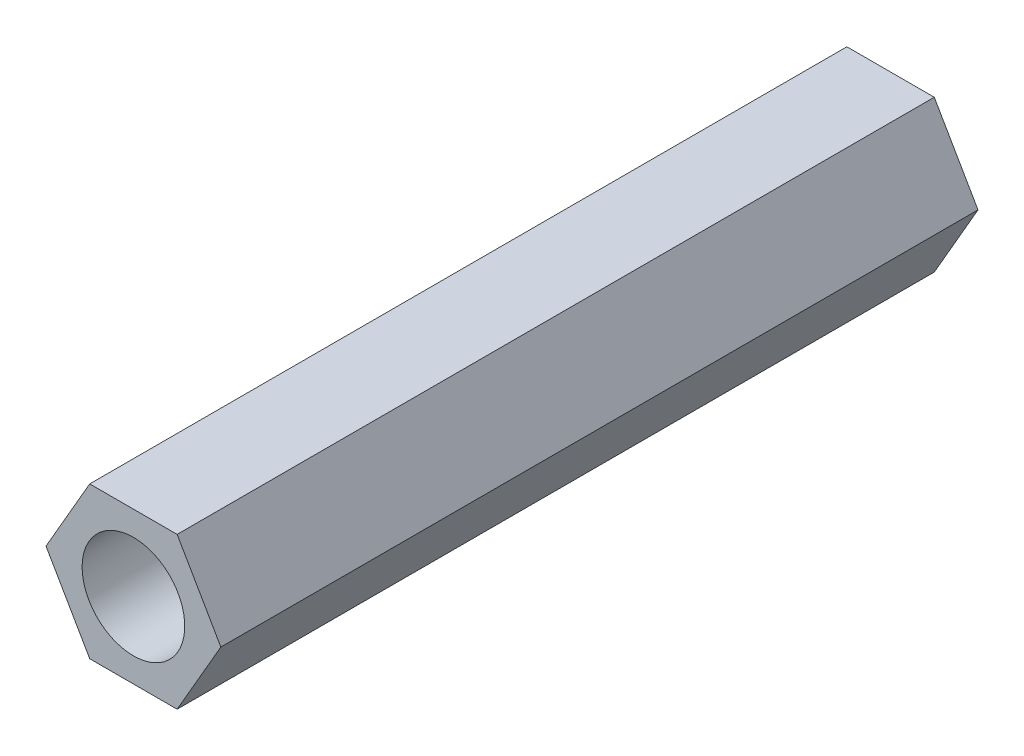
ISO-10303-21;
HEADER;
FILE_DESCRIPTION(('STEP AP214'),'2;1');
FILE_NAME('part.step','',(''),(''),'','','');
FILE_SCHEMA(('AUTOMOTIVE_DESIGN { 1 0 10303 214 1 1 1 1 }'));
ENDSEC;
DATA;
#1=APPLICATION_CONTEXT('core data for automotive mechanical design processes');
#2=APPLICATION_PROTOCOL_DEFINITION('international standard','automotive_design',2000,#1);
#3=PRODUCT_CONTEXT('',#1,'mechanical');
#4=PRODUCT('Part','Part','',(#3));
#5=PRODUCT_RELATED_PRODUCT_CATEGORY('part','',(#4));
#6=PRODUCT_DEFINITION_FORMATION('','',#4);
#7=PRODUCT_DEFINITION_CONTEXT('part definition',#1,'design');
#8=PRODUCT_DEFINITION('design','',#6,#7);
#9=PRODUCT_DEFINITION_SHAPE('','',#8);
#10=(LENGTH_UNIT() NAMED_UNIT(*) SI_UNIT(.MILLI.,.METRE.));
#11=(NAMED_UNIT(*) PLANE_ANGLE_UNIT() SI_UNIT($,.RADIAN.));
#12=(NAMED_UNIT(*) SI_UNIT($,.STERADIAN.) SOLID_ANGLE_UNIT());
#13=UNCERTAINTY_MEASURE_WITH_UNIT(LENGTH_MEASURE(1.E-05),#10,'distance_accuracy_value','');
#14=(GEOMETRIC_REPRESENTATION_CONTEXT(3) GLOBAL_UNCERTAINTY_ASSIGNED_CONTEXT((#13)) GLOBAL_UNIT_ASSIGNED_CONTEXT((#10,
#11,#12)) REPRESENTATION_CONTEXT('',''));
#15=CARTESIAN_POINT('',(0.,0.,0.));
#16=DIRECTION('',(0.,0.,1.));
#17=DIRECTION('',(1.,0.,0.));
#18=AXIS2_PLACEMENT_3D('',#15,#16,#17);
#19=CARTESIAN_POINT('',(1.83308710467706,-3.175,15.875));
#20=DIRECTION('',(-0.866025403784439,0.5,0.));
#21=DIRECTION('',(-0.5,-0.866025403784439,0.));
#22=AXIS2_PLACEMENT_3D('',#19,#20,#21);
#23=PLANE('',#22);
#24=DIRECTION('',(0.,0.,1.));
#25=VECTOR('',#24,1.);
#26=CARTESIAN_POINT('',(3.66617420935412,0.,15.875));
#27=LINE('',#26,#25);
#28=CARTESIAN_POINT('',(3.66617420935412,0.,-15.875));
#29=VERTEX_POINT('',#28);
#30=CARTESIAN_POINT('',(3.66617420935412,0.,15.875));
#31=VERTEX_POINT('',#30);
#32=EDGE_CURVE('E65',#29,#31,#27,.T.);
#33=ORIENTED_EDGE('',*,*,#32,.T.);
#34=DIRECTION('',(0.5,0.866025403784439,0.));
#35=VECTOR('',#34,1.);
#36=CARTESIAN_POINT('',(1.83308710467706,-3.175,15.875));
#37=LINE('',#36,#35);
#38=CARTESIAN_POINT('',(1.83308710467706,-3.175,15.875));
#39=VERTEX_POINT('',#38);
#40=EDGE_CURVE('E105',#39,#31,#37,.T.);
#41=ORIENTED_EDGE('',*,*,#40,.F.);
#42=DIRECTION('',(0.,0.,1.));
#43=VECTOR('',#42,1.);
#44=CARTESIAN_POINT('',(1.83308710467706,-3.175,15.875));
#45=LINE('',#44,#43);
#46=CARTESIAN_POINT('',(1.83308710467706,-3.175,-15.875));
#47=VERTEX_POINT('',#46);
#48=EDGE_CURVE('E92',#39,#47,#45,.F.);
#49=ORIENTED_EDGE('',*,*,#48,.T.);
#50=DIRECTION('',(0.5,0.866025403784439,0.));
#51=VECTOR('',#50,1.);
#52=CARTESIAN_POINT('',(1.83308710467706,-3.175,-15.875));
#53=LINE('',#52,#51);
#54=EDGE_CURVE('E106',#47,#29,#53,.T.);
#55=ORIENTED_EDGE('',*,*,#54,.T.);
#56=EDGE_LOOP('',(#33,#41,#49,#55));
#57=FACE_BOUND('',#56,.T.);
#58=ADVANCED_FACE('F16',(#57),#23,.F.);
#59=CARTESIAN_POINT('',(3.66617420935412,0.,15.875));
#60=DIRECTION('',(-0.866025403784439,-0.5,0.));
#61=DIRECTION('',(0.5,-0.866025403784439,0.));
#62=AXIS2_PLACEMENT_3D('',#59,#60,#61);
#63=PLANE('',#62);
#64=DIRECTION('',(0.,0.,1.));
#65=VECTOR('',#64,1.);
#66=CARTESIAN_POINT('',(1.83308710467705,3.175,15.875));
#67=LINE('',#66,#65);
#68=CARTESIAN_POINT('',(1.83308710467705,3.175,-15.875));
#69=VERTEX_POINT('',#68);
#70=CARTESIAN_POINT('',(1.83308710467705,3.175,15.875));
#71=VERTEX_POINT('',#70);
#72=EDGE_CURVE('E72',#69,#71,#67,.T.);
#73=ORIENTED_EDGE('',*,*,#72,.T.);
#74=DIRECTION('',(-0.5,0.866025403784439,0.));
#75=VECTOR('',#74,1.);
#76=CARTESIAN_POINT('',(3.66617420935412,0.,15.875));
#77=LINE('',#76,#75);
#78=EDGE_CURVE('E107',#31,#71,#77,.T.);
#79=ORIENTED_EDGE('',*,*,#78,.F.);
#80=ORIENTED_EDGE('',*,*,#32,.F.);
#81=DIRECTION('',(-0.5,0.866025403784439,0.));
#82=VECTOR('',#81,1.);
#83=CARTESIAN_POINT('',(3.66617420935412,0.,-15.875));
#84=LINE('',#83,#82);
#85=EDGE_CURVE('E85',#29,#69,#84,.T.);
#86=ORIENTED_EDGE('',*,*,#85,.T.);
#87=EDGE_LOOP('',(#73,#79,#80,#86));
#88=FACE_BOUND('',#87,.T.);
#89=ADVANCED_FACE('F91',(#88),#63,.F.);
#90=CARTESIAN_POINT('',(1.83308710467705,3.175,15.875));
#91=DIRECTION('',(0.,-1.,0.));
#92=DIRECTION('',(1.,0.,0.));
#93=AXIS2_PLACEMENT_3D('',#90,#91,#92);
#94=PLANE('',#93);
#95=DIRECTION('',(0.,0.,1.));
#96=VECTOR('',#95,1.);
#97=CARTESIAN_POINT('',(-1.83308710467706,3.175,15.875));
#98=LINE('',#97,#96);
#99=CARTESIAN_POINT('',(-1.83308710467706,3.175,-15.875));
#100=VERTEX_POINT('',#99);
#101=CARTESIAN_POINT('',(-1.83308710467706,3.175,15.875));
#102=VERTEX_POINT('',#101);
#103=EDGE_CURVE('E78',#100,#102,#98,.T.);
#104=ORIENTED_EDGE('',*,*,#103,.T.);
#105=DIRECTION('',(1.,0.,0.));
#106=VECTOR('',#105,1.);
#107=CARTESIAN_POINT('',(3.66617420935412,3.175,15.875));
#108=LINE('',#107,#106);
#109=EDGE_CURVE('E77',#71,#102,#108,.F.);
#110=ORIENTED_EDGE('',*,*,#109,.F.);
#111=ORIENTED_EDGE('',*,*,#72,.F.);
#112=DIRECTION('',(1.,0.,0.));
#113=VECTOR('',#112,1.);
#114=CARTESIAN_POINT('',(3.66617420935412,3.175,-15.875));
#115=LINE('',#114,#113);
#116=EDGE_CURVE('E76',#69,#100,#115,.F.);
#117=ORIENTED_EDGE('',*,*,#116,.T.);
#118=EDGE_LOOP('',(#104,#110,#111,#117));
#119=FACE_BOUND('',#118,.T.);
#120=ADVANCED_FACE('F75',(#119),#94,.F.);
#121=CARTESIAN_POINT('',(-1.83308710467706,3.175,15.875));
#122=DIRECTION('',(0.866025403784439,-0.5,0.));
#123=DIRECTION('',(0.5,0.866025403784439,0.));
#124=AXIS2_PLACEMENT_3D('',#121,#122,#123);
#125=PLANE('',#124);
#126=DIRECTION('',(0.,0.,1.));
#127=VECTOR('',#126,1.);
#128=CARTESIAN_POINT('',(-3.66617420935413,0.,15.875));
#129=LINE('',#128,#127);
#130=CARTESIAN_POINT('',(-3.66617420935413,0.,-15.875));
#131=VERTEX_POINT('',#130);
#132=CARTESIAN_POINT('',(-3.66617420935413,0.,15.875));
#133=VERTEX_POINT('',#132);
#134=EDGE_CURVE('E99',#131,#133,#129,.T.);
#135=ORIENTED_EDGE('',*,*,#134,.T.);
#136=DIRECTION('',(-0.5,-0.866025403784439,0.));
#137=VECTOR('',#136,1.);
#138=CARTESIAN_POINT('',(-1.83308710467706,3.175,15.875));
#139=LINE('',#138,#137);
#140=EDGE_CURVE('E109',#102,#133,#139,.T.);
#141=ORIENTED_EDGE('',*,*,#140,.F.);
#142=ORIENTED_EDGE('',*,*,#103,.F.);
#143=DIRECTION('',(-0.5,-0.866025403784439,0.));
#144=VECTOR('',#143,1.);
#145=CARTESIAN_POINT('',(-1.83308710467706,3.175,-15.875));
#146=LINE('',#145,#144);
#147=EDGE_CURVE('E89',#100,#131,#146,.T.);
#148=ORIENTED_EDGE('',*,*,#147,.T.);
#149=EDGE_LOOP('',(#135,#141,#142,#148));
#150=FACE_BOUND('',#149,.T.);
#151=ADVANCED_FACE('F121',(#150),#125,.F.);
#152=CARTESIAN_POINT('',(-3.66617420935413,0.,15.875));
#153=DIRECTION('',(0.866025403784439,0.5,0.));
#154=DIRECTION('',(-0.5,0.866025403784439,0.));
#155=AXIS2_PLACEMENT_3D('',#152,#153,#154);
#156=PLANE('',#155);
#157=DIRECTION('',(0.,0.,1.));
#158=VECTOR('',#157,1.);
#159=CARTESIAN_POINT('',(-1.83308710467707,-3.175,15.875));
#160=LINE('',#159,#158);
#161=CARTESIAN_POINT('',(-1.83308710467707,-3.175,-15.875));
#162=VERTEX_POINT('',#161);
#163=CARTESIAN_POINT('',(-1.83308710467707,-3.175,15.875));
#164=VERTEX_POINT('',#163);
#165=EDGE_CURVE('E94',#162,#164,#160,.T.);
#166=ORIENTED_EDGE('',*,*,#165,.T.);
#167=DIRECTION('',(0.5,-0.866025403784439,0.));
#168=VECTOR('',#167,1.);
#169=CARTESIAN_POINT('',(-3.66617420935413,0.,15.875));
#170=LINE('',#169,#168);
#171=EDGE_CURVE('E32',#133,#164,#170,.T.);
#172=ORIENTED_EDGE('',*,*,#171,.F.);
#173=ORIENTED_EDGE('',*,*,#134,.F.);
#174=DIRECTION('',(0.5,-0.866025403784439,0.));
#175=VECTOR('',#174,1.);
#176=CARTESIAN_POINT('',(-3.66617420935413,0.,-15.875));
#177=LINE('',#176,#175);
#178=EDGE_CURVE('E118',#131,#162,#177,.T.);
#179=ORIENTED_EDGE('',*,*,#178,.T.);
#180=EDGE_LOOP('',(#166,#172,#173,#179));
#181=FACE_BOUND('',#180,.T.);
#182=ADVANCED_FACE('F149',(#181),#156,.F.);
#183=CARTESIAN_POINT('',(-1.83308710467707,-3.175,15.875));
#184=DIRECTION('',(0.,1.,0.));
#185=DIRECTION('',(-1.,0.,0.));
#186=AXIS2_PLACEMENT_3D('',#183,#184,#185);
#187=PLANE('',#186);
#188=ORIENTED_EDGE('',*,*,#48,.F.);
#189=DIRECTION('',(1.,0.,0.));
#190=VECTOR('',#189,1.);
#191=CARTESIAN_POINT('',(3.66617420935412,-3.175,15.875));
#192=LINE('',#191,#190);
#193=EDGE_CURVE('E123',#164,#39,#192,.T.);
#194=ORIENTED_EDGE('',*,*,#193,.F.);
#195=ORIENTED_EDGE('',*,*,#165,.F.);
#196=DIRECTION('',(1.,0.,0.));
#197=VECTOR('',#196,1.);
#198=CARTESIAN_POINT('',(3.66617420935412,-3.175,-15.875));
#199=LINE('',#198,#197);
#200=EDGE_CURVE('E115',#162,#47,#199,.T.);
#201=ORIENTED_EDGE('',*,*,#200,.T.);
#202=EDGE_LOOP('',(#188,#194,#195,#201));
#203=FACE_BOUND('',#202,.T.);
#204=ADVANCED_FACE('F144',(#203),#187,.F.);
#205=CARTESIAN_POINT('',(3.66617420935412,0.,-15.875));
#206=DIRECTION('',(0.,0.,1.));
#207=DIRECTION('',(1.,0.,0.));
#208=AXIS2_PLACEMENT_3D('',#205,#206,#207);
#209=PLANE('',#208);
#210=CARTESIAN_POINT('',(0.,0.,-15.875));
#211=DIRECTION('',(0.,0.,-1.));
#212=DIRECTION('',(-1.,0.,0.));
#213=AXIS2_PLACEMENT_3D('',#210,#211,#212);
#214=CIRCLE('',#213,2.15265);
#215=CARTESIAN_POINT('',(-2.15265,0.,-15.875));
#216=VERTEX_POINT('',#215);
#217=EDGE_CURVE('E19',#216,#216,#214,.F.);
#218=ORIENTED_EDGE('',*,*,#217,.T.);
#219=EDGE_LOOP('',(#218));
#220=FACE_BOUND('',#219,.T.);
#221=ORIENTED_EDGE('',*,*,#200,.F.);
#222=ORIENTED_EDGE('',*,*,#178,.F.);
#223=ORIENTED_EDGE('',*,*,#147,.F.);
#224=ORIENTED_EDGE('',*,*,#116,.F.);
#225=ORIENTED_EDGE('',*,*,#85,.F.);
#226=ORIENTED_EDGE('',*,*,#54,.F.);
#227=EDGE_LOOP('',(#221,#222,#223,#224,#225,#226));
#228=FACE_BOUND('',#227,.T.);
#229=ADVANCED_FACE('F83',(#220,#228),#209,.F.);
#230=CARTESIAN_POINT('',(3.66617420935412,0.,15.875));
#231=DIRECTION('',(0.,0.,1.));
#232=DIRECTION('',(1.,0.,0.));
#233=AXIS2_PLACEMENT_3D('',#230,#231,#232);
#234=PLANE('',#233);
#235=CARTESIAN_POINT('',(0.,0.,15.875));
#236=DIRECTION('',(0.,0.,-1.));
#237=DIRECTION('',(-1.,0.,0.));
#238=AXIS2_PLACEMENT_3D('',#235,#236,#237);
#239=CIRCLE('',#238,2.15265);
#240=CARTESIAN_POINT('',(-2.15265,0.,15.875));
#241=VERTEX_POINT('',#240);
#242=EDGE_CURVE('E11',#241,#241,#239,.T.);
#243=ORIENTED_EDGE('',*,*,#242,.T.);
#244=EDGE_LOOP('',(#243));
#245=FACE_BOUND('',#244,.T.);
#246=ORIENTED_EDGE('',*,*,#171,.T.);
#247=ORIENTED_EDGE('',*,*,#193,.T.);
#248=ORIENTED_EDGE('',*,*,#40,.T.);
#249=ORIENTED_EDGE('',*,*,#78,.T.);
#250=ORIENTED_EDGE('',*,*,#109,.T.);
#251=ORIENTED_EDGE('',*,*,#140,.T.);
#252=EDGE_LOOP('',(#246,#247,#248,#249,#250,#251));
#253=FACE_BOUND('',#252,.T.);
#254=ADVANCED_FACE('F134',(#245,#253),#234,.T.);
#255=CARTESIAN_POINT('',(0.,0.,15.875));
#256=DIRECTION('',(0.,0.,-1.));
#257=DIRECTION('',(-1.,0.,0.));
#258=AXIS2_PLACEMENT_3D('',#255,#256,#257);
#259=CYLINDRICAL_SURFACE('',#258,2.15265);
#260=ORIENTED_EDGE('',*,*,#217,.F.);
#261=EDGE_LOOP('',(#260));
#262=FACE_BOUND('',#261,.T.);
#263=ORIENTED_EDGE('',*,*,#242,.F.);
#264=EDGE_LOOP('',(#263));
#265=FACE_BOUND('',#264,.T.);
#266=ADVANCED_FACE('F131',(#262,#265),#259,.F.);
#267=CLOSED_SHELL('',(#58,#89,#120,#151,#182,#204,#229,#254,#266));
#268=MANIFOLD_SOLID_BREP('B1',#267);
#269=ADVANCED_BREP_SHAPE_REPRESENTATION('',(#18,#268),#14);
#270=SHAPE_DEFINITION_REPRESENTATION(#9,#269);
ENDSEC;
END-ISO-10303-21;
